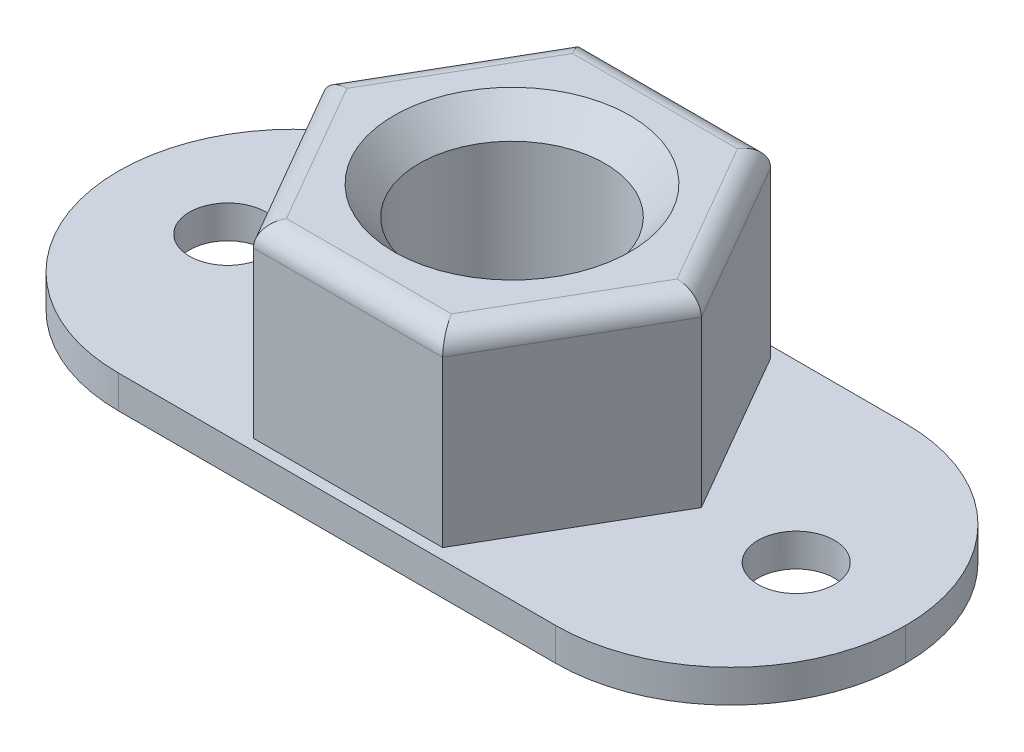
ISO-10303-21;
HEADER;
FILE_DESCRIPTION(('STEP AP214'),'2;1');
FILE_NAME('part.step','',(''),(''),'','','');
FILE_SCHEMA(('AUTOMOTIVE_DESIGN { 1 0 10303 214 1 1 1 1 }'));
ENDSEC;
DATA;
#1=APPLICATION_CONTEXT('core data for automotive mechanical design processes');
#2=APPLICATION_PROTOCOL_DEFINITION('international standard','automotive_design',2000,#1);
#3=PRODUCT_CONTEXT('',#1,'mechanical');
#4=PRODUCT('Part','Part','',(#3));
#5=PRODUCT_RELATED_PRODUCT_CATEGORY('part','',(#4));
#6=PRODUCT_DEFINITION_FORMATION('','',#4);
#7=PRODUCT_DEFINITION_CONTEXT('part definition',#1,'design');
#8=PRODUCT_DEFINITION('design','',#6,#7);
#9=PRODUCT_DEFINITION_SHAPE('','',#8);
#10=(LENGTH_UNIT() NAMED_UNIT(*) SI_UNIT(.MILLI.,.METRE.));
#11=(NAMED_UNIT(*) PLANE_ANGLE_UNIT() SI_UNIT($,.RADIAN.));
#12=(NAMED_UNIT(*) SI_UNIT($,.STERADIAN.) SOLID_ANGLE_UNIT());
#13=UNCERTAINTY_MEASURE_WITH_UNIT(LENGTH_MEASURE(1.E-05),#10,'distance_accuracy_value','');
#14=(GEOMETRIC_REPRESENTATION_CONTEXT(3) GLOBAL_UNCERTAINTY_ASSIGNED_CONTEXT((#13)) GLOBAL_UNIT_ASSIGNED_CONTEXT((#10,
#11,#12)) REPRESENTATION_CONTEXT('',''));
#15=CARTESIAN_POINT('',(0.,0.,0.));
#16=DIRECTION('',(0.,0.,1.));
#17=DIRECTION('',(1.,0.,0.));
#18=AXIS2_PLACEMENT_3D('',#15,#16,#17);
#19=CARTESIAN_POINT('',(6.87407664253899,13.49375,11.90625));
#20=DIRECTION('',(-0.866025403784438,0.,-0.5));
#21=DIRECTION('',(-0.5,0.,0.866025403784439));
#22=AXIS2_PLACEMENT_3D('',#19,#20,#21);
#23=PLANE('',#22);
#24=DIRECTION('',(0.,-1.,0.));
#25=VECTOR('',#24,1.);
#26=CARTESIAN_POINT('',(13.748153285078,13.49375,0.));
#27=LINE('',#26,#25);
#28=CARTESIAN_POINT('',(13.748153285078,11.96975,0.));
#29=VERTEX_POINT('',#28);
#30=CARTESIAN_POINT('',(13.748153285078,0.,0.));
#31=VERTEX_POINT('',#30);
#32=EDGE_CURVE('E157',#29,#31,#27,.T.);
#33=ORIENTED_EDGE('',*,*,#32,.F.);
#34=DIRECTION('',(0.5,0.,-0.866025403784439));
#35=VECTOR('',#34,1.);
#36=CARTESIAN_POINT('',(6.87407664253899,11.96975,11.90625));
#37=LINE('',#36,#35);
#38=CARTESIAN_POINT('',(6.87407664253899,11.96975,11.90625));
#39=VERTEX_POINT('',#38);
#40=EDGE_CURVE('E213',#29,#39,#37,.F.);
#41=ORIENTED_EDGE('',*,*,#40,.T.);
#42=DIRECTION('',(0.,-1.,0.));
#43=VECTOR('',#42,1.);
#44=CARTESIAN_POINT('',(6.87407664253899,13.49375,11.90625));
#45=LINE('',#44,#43);
#46=CARTESIAN_POINT('',(6.87407664253899,0.,11.90625));
#47=VERTEX_POINT('',#46);
#48=EDGE_CURVE('E167',#39,#47,#45,.T.);
#49=ORIENTED_EDGE('',*,*,#48,.T.);
#50=DIRECTION('',(0.5,0.,-0.866025403784438));
#51=VECTOR('',#50,1.);
#52=CARTESIAN_POINT('',(6.87407664253899,0.,11.90625));
#53=LINE('',#52,#51);
#54=EDGE_CURVE('E148',#47,#31,#53,.T.);
#55=ORIENTED_EDGE('',*,*,#54,.T.);
#56=EDGE_LOOP('',(#33,#41,#49,#55));
#57=FACE_BOUND('',#56,.T.);
#58=ADVANCED_FACE('F36',(#57),#23,.F.);
#59=CARTESIAN_POINT('',(13.748153285078,13.49375,0.));
#60=DIRECTION('',(-0.866025403784438,0.,0.5));
#61=DIRECTION('',(0.5,0.,0.866025403784439));
#62=AXIS2_PLACEMENT_3D('',#59,#60,#61);
#63=PLANE('',#62);
#64=DIRECTION('',(0.,-1.,0.));
#65=VECTOR('',#64,1.);
#66=CARTESIAN_POINT('',(6.87407664253898,13.49375,-11.90625));
#67=LINE('',#66,#65);
#68=CARTESIAN_POINT('',(6.87407664253898,11.96975,-11.90625));
#69=VERTEX_POINT('',#68);
#70=CARTESIAN_POINT('',(6.87407664253898,0.,-11.90625));
#71=VERTEX_POINT('',#70);
#72=EDGE_CURVE('E164',#69,#71,#67,.T.);
#73=ORIENTED_EDGE('',*,*,#72,.F.);
#74=DIRECTION('',(-0.5,0.,-0.866025403784439));
#75=VECTOR('',#74,1.);
#76=CARTESIAN_POINT('',(13.748153285078,11.96975,0.));
#77=LINE('',#76,#75);
#78=EDGE_CURVE('E160',#69,#29,#77,.F.);
#79=ORIENTED_EDGE('',*,*,#78,.T.);
#80=ORIENTED_EDGE('',*,*,#32,.T.);
#81=DIRECTION('',(-0.5,0.,-0.866025403784439));
#82=VECTOR('',#81,1.);
#83=CARTESIAN_POINT('',(13.748153285078,0.,0.));
#84=LINE('',#83,#82);
#85=EDGE_CURVE('E144',#31,#71,#84,.T.);
#86=ORIENTED_EDGE('',*,*,#85,.T.);
#87=EDGE_LOOP('',(#73,#79,#80,#86));
#88=FACE_BOUND('',#87,.T.);
#89=ADVANCED_FACE('F158',(#88),#63,.F.);
#90=CARTESIAN_POINT('',(6.87407664253898,13.49375,-11.90625));
#91=DIRECTION('',(0.,0.,1.));
#92=DIRECTION('',(1.,0.,0.));
#93=AXIS2_PLACEMENT_3D('',#90,#91,#92);
#94=PLANE('',#93);
#95=DIRECTION('',(0.,-1.,0.));
#96=VECTOR('',#95,1.);
#97=CARTESIAN_POINT('',(-6.87407664253898,13.49375,-11.90625));
#98=LINE('',#97,#96);
#99=CARTESIAN_POINT('',(-6.87407664253898,11.96975,-11.90625));
#100=VERTEX_POINT('',#99);
#101=CARTESIAN_POINT('',(-6.87407664253898,0.,-11.90625));
#102=VERTEX_POINT('',#101);
#103=EDGE_CURVE('E193',#100,#102,#98,.T.);
#104=ORIENTED_EDGE('',*,*,#103,.F.);
#105=DIRECTION('',(-1.,0.,0.));
#106=VECTOR('',#105,1.);
#107=CARTESIAN_POINT('',(6.87407664253898,11.96975,-11.90625));
#108=LINE('',#107,#106);
#109=EDGE_CURVE('E209',#100,#69,#108,.F.);
#110=ORIENTED_EDGE('',*,*,#109,.T.);
#111=ORIENTED_EDGE('',*,*,#72,.T.);
#112=DIRECTION('',(-1.,0.,0.));
#113=VECTOR('',#112,1.);
#114=CARTESIAN_POINT('',(6.87407664253898,0.,-11.90625));
#115=LINE('',#114,#113);
#116=EDGE_CURVE('E151',#71,#102,#115,.T.);
#117=ORIENTED_EDGE('',*,*,#116,.T.);
#118=EDGE_LOOP('',(#104,#110,#111,#117));
#119=FACE_BOUND('',#118,.T.);
#120=ADVANCED_FACE('F319',(#119),#94,.F.);
#121=CARTESIAN_POINT('',(-6.87407664253898,13.49375,-11.90625));
#122=DIRECTION('',(0.866025403784439,0.,0.5));
#123=DIRECTION('',(0.5,0.,-0.866025403784439));
#124=AXIS2_PLACEMENT_3D('',#121,#122,#123);
#125=PLANE('',#124);
#126=DIRECTION('',(0.,-1.,0.));
#127=VECTOR('',#126,1.);
#128=CARTESIAN_POINT('',(-13.748153285078,13.49375,0.));
#129=LINE('',#128,#127);
#130=CARTESIAN_POINT('',(-13.748153285078,11.96975,0.));
#131=VERTEX_POINT('',#130);
#132=CARTESIAN_POINT('',(-13.748153285078,0.,0.));
#133=VERTEX_POINT('',#132);
#134=EDGE_CURVE('E190',#131,#133,#129,.T.);
#135=ORIENTED_EDGE('',*,*,#134,.F.);
#136=DIRECTION('',(-0.5,0.,0.866025403784439));
#137=VECTOR('',#136,1.);
#138=CARTESIAN_POINT('',(-6.87407664253898,11.96975,-11.90625));
#139=LINE('',#138,#137);
#140=EDGE_CURVE('E219',#131,#100,#139,.F.);
#141=ORIENTED_EDGE('',*,*,#140,.T.);
#142=ORIENTED_EDGE('',*,*,#103,.T.);
#143=DIRECTION('',(-0.5,0.,0.866025403784439));
#144=VECTOR('',#143,1.);
#145=CARTESIAN_POINT('',(-6.87407664253898,0.,-11.90625));
#146=LINE('',#145,#144);
#147=EDGE_CURVE('E178',#102,#133,#146,.T.);
#148=ORIENTED_EDGE('',*,*,#147,.T.);
#149=EDGE_LOOP('',(#135,#141,#142,#148));
#150=FACE_BOUND('',#149,.T.);
#151=ADVANCED_FACE('F529',(#150),#125,.F.);
#152=CARTESIAN_POINT('',(-13.748153285078,13.49375,0.));
#153=DIRECTION('',(0.866025403784438,0.,-0.5));
#154=DIRECTION('',(-0.5,0.,-0.866025403784438));
#155=AXIS2_PLACEMENT_3D('',#152,#153,#154);
#156=PLANE('',#155);
#157=DIRECTION('',(0.,-1.,0.));
#158=VECTOR('',#157,1.);
#159=CARTESIAN_POINT('',(-6.87407664253898,13.49375,11.90625));
#160=LINE('',#159,#158);
#161=CARTESIAN_POINT('',(-6.87407664253898,11.96975,11.90625));
#162=VERTEX_POINT('',#161);
#163=CARTESIAN_POINT('',(-6.87407664253898,0.,11.90625));
#164=VERTEX_POINT('',#163);
#165=EDGE_CURVE('E187',#162,#164,#160,.T.);
#166=ORIENTED_EDGE('',*,*,#165,.F.);
#167=DIRECTION('',(0.5,0.,0.866025403784438));
#168=VECTOR('',#167,1.);
#169=CARTESIAN_POINT('',(-13.748153285078,11.96975,0.));
#170=LINE('',#169,#168);
#171=EDGE_CURVE('E217',#162,#131,#170,.F.);
#172=ORIENTED_EDGE('',*,*,#171,.T.);
#173=ORIENTED_EDGE('',*,*,#134,.T.);
#174=DIRECTION('',(0.5,0.,0.866025403784438));
#175=VECTOR('',#174,1.);
#176=CARTESIAN_POINT('',(-13.748153285078,0.,0.));
#177=LINE('',#176,#175);
#178=EDGE_CURVE('E181',#133,#164,#177,.T.);
#179=ORIENTED_EDGE('',*,*,#178,.T.);
#180=EDGE_LOOP('',(#166,#172,#173,#179));
#181=FACE_BOUND('',#180,.T.);
#182=ADVANCED_FACE('F311',(#181),#156,.F.);
#183=CARTESIAN_POINT('',(-6.87407664253898,13.49375,11.90625));
#184=DIRECTION('',(0.,0.,-1.));
#185=DIRECTION('',(-1.,0.,0.));
#186=AXIS2_PLACEMENT_3D('',#183,#184,#185);
#187=PLANE('',#186);
#188=ORIENTED_EDGE('',*,*,#48,.F.);
#189=DIRECTION('',(1.,0.,0.));
#190=VECTOR('',#189,1.);
#191=CARTESIAN_POINT('',(-6.87407664253898,11.96975,11.90625));
#192=LINE('',#191,#190);
#193=EDGE_CURVE('E215',#39,#162,#192,.F.);
#194=ORIENTED_EDGE('',*,*,#193,.T.);
#195=ORIENTED_EDGE('',*,*,#165,.T.);
#196=DIRECTION('',(1.,0.,0.));
#197=VECTOR('',#196,1.);
#198=CARTESIAN_POINT('',(-6.87407664253898,0.,11.90625));
#199=LINE('',#198,#197);
#200=EDGE_CURVE('E184',#164,#47,#199,.T.);
#201=ORIENTED_EDGE('',*,*,#200,.T.);
#202=EDGE_LOOP('',(#188,#194,#195,#201));
#203=FACE_BOUND('',#202,.T.);
#204=ADVANCED_FACE('F302',(#203),#187,.F.);
#205=CARTESIAN_POINT('',(0.,13.49375,0.));
#206=DIRECTION('',(0.,1.,0.));
#207=DIRECTION('',(0.,0.,1.));
#208=AXIS2_PLACEMENT_3D('',#205,#206,#207);
#209=PLANE('',#208);
#210=DIRECTION('',(-0.5,0.,-0.866025403784439));
#211=VECTOR('',#210,1.);
#212=CARTESIAN_POINT('',(5.5542539271715,13.49375,-11.14425));
#213=LINE('',#212,#211);
#214=CARTESIAN_POINT('',(11.988389664588,13.49375,0.));
#215=VERTEX_POINT('',#214);
#216=CARTESIAN_POINT('',(5.99419483229399,13.49375,-10.38225));
#217=VERTEX_POINT('',#216);
#218=EDGE_CURVE('E204',#215,#217,#213,.T.);
#219=ORIENTED_EDGE('',*,*,#218,.T.);
#220=DIRECTION('',(-1.,0.,0.));
#221=VECTOR('',#220,1.);
#222=CARTESIAN_POINT('',(-6.87407664253898,13.49375,-10.38225));
#223=LINE('',#222,#221);
#224=CARTESIAN_POINT('',(-5.99419483229399,13.49375,-10.38225));
#225=VERTEX_POINT('',#224);
#226=EDGE_CURVE('E206',#217,#225,#223,.T.);
#227=ORIENTED_EDGE('',*,*,#226,.T.);
#228=DIRECTION('',(-0.5,0.,0.866025403784439));
#229=VECTOR('',#228,1.);
#230=CARTESIAN_POINT('',(-12.4283305697105,13.49375,0.761999999999997));
#231=LINE('',#230,#229);
#232=CARTESIAN_POINT('',(-11.988389664588,13.49375,0.));
#233=VERTEX_POINT('',#232);
#234=EDGE_CURVE('E163',#225,#233,#231,.T.);
#235=ORIENTED_EDGE('',*,*,#234,.T.);
#236=DIRECTION('',(0.5,0.,0.866025403784438));
#237=VECTOR('',#236,1.);
#238=CARTESIAN_POINT('',(-5.55425392717149,13.49375,11.14425));
#239=LINE('',#238,#237);
#240=CARTESIAN_POINT('',(-5.99419483229399,13.49375,10.38225));
#241=VERTEX_POINT('',#240);
#242=EDGE_CURVE('E198',#233,#241,#239,.T.);
#243=ORIENTED_EDGE('',*,*,#242,.T.);
#244=DIRECTION('',(1.,0.,0.));
#245=VECTOR('',#244,1.);
#246=CARTESIAN_POINT('',(6.87407664253899,13.49375,10.38225));
#247=LINE('',#246,#245);
#248=CARTESIAN_POINT('',(5.994194832294,13.49375,10.38225));
#249=VERTEX_POINT('',#248);
#250=EDGE_CURVE('E200',#241,#249,#247,.T.);
#251=ORIENTED_EDGE('',*,*,#250,.T.);
#252=DIRECTION('',(0.5,0.,-0.866025403784439));
#253=VECTOR('',#252,1.);
#254=CARTESIAN_POINT('',(12.4283305697105,13.49375,-0.761999999999999));
#255=LINE('',#254,#253);
#256=EDGE_CURVE('E202',#249,#215,#255,.T.);
#257=ORIENTED_EDGE('',*,*,#256,.T.);
#258=EDGE_LOOP('',(#219,#227,#235,#243,#251,#257));
#259=FACE_BOUND('',#258,.T.);
#260=CARTESIAN_POINT('',(0.,13.49375,0.));
#261=DIRECTION('',(0.,1.,0.));
#262=DIRECTION('',(0.,0.,1.));
#263=AXIS2_PLACEMENT_3D('',#260,#261,#262);
#264=CIRCLE('',#263,8.5725);
#265=CARTESIAN_POINT('',(0.,13.49375,8.5725));
#266=VERTEX_POINT('',#265);
#267=EDGE_CURVE('E172',#266,#266,#264,.T.);
#268=ORIENTED_EDGE('',*,*,#267,.F.);
#269=EDGE_LOOP('',(#268));
#270=FACE_BOUND('',#269,.T.);
#271=ADVANCED_FACE('F299',(#259,#270),#209,.T.);
#272=CARTESIAN_POINT('',(0.,13.49375,0.));
#273=DIRECTION('',(0.,1.,0.));
#274=DIRECTION('',(0.,0.,1.));
#275=AXIS2_PLACEMENT_3D('',#272,#273,#274);
#276=CYLINDRICAL_SURFACE('',#275,6.74624);
#277=CARTESIAN_POINT('',(0.,0.,0.));
#278=DIRECTION('',(0.,1.,0.));
#279=DIRECTION('',(0.,0.,1.));
#280=AXIS2_PLACEMENT_3D('',#277,#278,#279);
#281=CIRCLE('',#280,6.74623999999999);
#282=CARTESIAN_POINT('',(0.,0.,6.74623999999999));
#283=VERTEX_POINT('',#282);
#284=EDGE_CURVE('E175',#283,#283,#281,.T.);
#285=ORIENTED_EDGE('',*,*,#284,.F.);
#286=EDGE_LOOP('',(#285));
#287=FACE_BOUND('',#286,.T.);
#288=CARTESIAN_POINT('',(0.,11.3928781926286,0.));
#289=DIRECTION('',(0.,1.,0.));
#290=DIRECTION('',(0.,0.,1.));
#291=AXIS2_PLACEMENT_3D('',#288,#289,#290);
#292=CIRCLE('',#291,6.74624);
#293=CARTESIAN_POINT('',(0.,11.3928781926286,6.74624));
#294=VERTEX_POINT('',#293);
#295=EDGE_CURVE('E169',#294,#294,#292,.T.);
#296=ORIENTED_EDGE('',*,*,#295,.T.);
#297=EDGE_LOOP('',(#296));
#298=FACE_BOUND('',#297,.T.);
#299=ADVANCED_FACE('F301',(#287,#298),#276,.F.);
#300=CARTESIAN_POINT('',(0.,13.49375,0.));
#301=DIRECTION('',(0.,1.,0.));
#302=DIRECTION('',(0.,0.,1.));
#303=AXIS2_PLACEMENT_3D('',#300,#301,#302);
#304=CONICAL_SURFACE('',#303,8.5725,0.715584993317675);
#305=ORIENTED_EDGE('',*,*,#295,.F.);
#306=EDGE_LOOP('',(#305));
#307=FACE_BOUND('',#306,.T.);
#308=ORIENTED_EDGE('',*,*,#267,.T.);
#309=EDGE_LOOP('',(#308));
#310=FACE_BOUND('',#309,.T.);
#311=ADVANCED_FACE('F297',(#307,#310),#304,.F.);
#312=CARTESIAN_POINT('',(0.,11.96975,10.38225));
#313=DIRECTION('',(-1.,0.,0.));
#314=DIRECTION('',(0.,0.,1.));
#315=AXIS2_PLACEMENT_3D('',#312,#313,#314);
#316=CYLINDRICAL_SURFACE('',#315,1.524);
#317=CARTESIAN_POINT('',(-5.99419483229399,11.96975,10.38225));
#318=DIRECTION('',(-0.866025403784439,0.,-0.5));
#319=DIRECTION('',(0.5,0.,-0.866025403784439));
#320=AXIS2_PLACEMENT_3D('',#317,#318,#319);
#321=ELLIPSE('',#320,1.75976362048998,1.524);
#322=EDGE_CURVE('E233',#162,#241,#321,.T.);
#323=ORIENTED_EDGE('',*,*,#322,.F.);
#324=ORIENTED_EDGE('',*,*,#193,.F.);
#325=CARTESIAN_POINT('',(5.994194832294,11.96975,10.38225));
#326=DIRECTION('',(-0.866025403784439,0.,0.5));
#327=DIRECTION('',(-0.5,0.,-0.866025403784439));
#328=AXIS2_PLACEMENT_3D('',#325,#326,#327);
#329=ELLIPSE('',#328,1.75976362048998,1.524);
#330=EDGE_CURVE('E236',#249,#39,#329,.F.);
#331=ORIENTED_EDGE('',*,*,#330,.F.);
#332=ORIENTED_EDGE('',*,*,#250,.F.);
#333=EDGE_LOOP('',(#323,#324,#331,#332));
#334=FACE_BOUND('',#333,.T.);
#335=ADVANCED_FACE('F343',(#334),#316,.T.);
#336=CARTESIAN_POINT('',(8.99129224844099,11.96975,5.191125));
#337=DIRECTION('',(-0.5,0.,0.866025403784439));
#338=DIRECTION('',(0.866025403784439,0.,0.5));
#339=AXIS2_PLACEMENT_3D('',#336,#337,#338);
#340=CYLINDRICAL_SURFACE('',#339,1.524);
#341=ORIENTED_EDGE('',*,*,#330,.T.);
#342=ORIENTED_EDGE('',*,*,#40,.F.);
#343=CARTESIAN_POINT('',(11.988389664588,11.96975,0.));
#344=DIRECTION('',(0.,0.,1.));
#345=DIRECTION('',(-1.,0.,0.));
#346=AXIS2_PLACEMENT_3D('',#343,#344,#345);
#347=ELLIPSE('',#346,1.75976362048998,1.524);
#348=EDGE_CURVE('E230',#215,#29,#347,.F.);
#349=ORIENTED_EDGE('',*,*,#348,.F.);
#350=ORIENTED_EDGE('',*,*,#256,.F.);
#351=EDGE_LOOP('',(#341,#342,#349,#350));
#352=FACE_BOUND('',#351,.T.);
#353=ADVANCED_FACE('F339',(#352),#340,.T.);
#354=CARTESIAN_POINT('',(-8.99129224844098,11.96975,5.191125));
#355=DIRECTION('',(-0.5,0.,-0.866025403784438));
#356=DIRECTION('',(-0.866025403784438,0.,0.5));
#357=AXIS2_PLACEMENT_3D('',#354,#355,#356);
#358=CYLINDRICAL_SURFACE('',#357,1.524);
#359=ORIENTED_EDGE('',*,*,#322,.T.);
#360=ORIENTED_EDGE('',*,*,#242,.F.);
#361=CARTESIAN_POINT('',(-11.988389664588,11.96975,0.));
#362=DIRECTION('',(0.,0.,-1.));
#363=DIRECTION('',(1.,0.,0.));
#364=AXIS2_PLACEMENT_3D('',#361,#362,#363);
#365=ELLIPSE('',#364,1.75976362048998,1.524);
#366=EDGE_CURVE('E227',#131,#233,#365,.T.);
#367=ORIENTED_EDGE('',*,*,#366,.F.);
#368=ORIENTED_EDGE('',*,*,#171,.F.);
#369=EDGE_LOOP('',(#359,#360,#367,#368));
#370=FACE_BOUND('',#369,.T.);
#371=ADVANCED_FACE('F335',(#370),#358,.T.);
#372=CARTESIAN_POINT('',(8.99129224844099,11.96975,-5.191125));
#373=DIRECTION('',(0.5,0.,0.866025403784439));
#374=DIRECTION('',(0.866025403784438,0.,-0.5));
#375=AXIS2_PLACEMENT_3D('',#372,#373,#374);
#376=CYLINDRICAL_SURFACE('',#375,1.524);
#377=ORIENTED_EDGE('',*,*,#348,.T.);
#378=ORIENTED_EDGE('',*,*,#78,.F.);
#379=CARTESIAN_POINT('',(5.99419483229399,11.96975,-10.38225));
#380=DIRECTION('',(0.866025403784439,0.,0.5));
#381=DIRECTION('',(-0.5,0.,0.866025403784439));
#382=AXIS2_PLACEMENT_3D('',#379,#380,#381);
#383=ELLIPSE('',#382,1.75976362048998,1.524);
#384=EDGE_CURVE('E224',#217,#69,#383,.F.);
#385=ORIENTED_EDGE('',*,*,#384,.F.);
#386=ORIENTED_EDGE('',*,*,#218,.F.);
#387=EDGE_LOOP('',(#377,#378,#385,#386));
#388=FACE_BOUND('',#387,.T.);
#389=ADVANCED_FACE('F331',(#388),#376,.T.);
#390=CARTESIAN_POINT('',(-8.99129224844099,11.96975,-5.191125));
#391=DIRECTION('',(0.5,0.,-0.866025403784439));
#392=DIRECTION('',(-0.866025403784439,0.,-0.5));
#393=AXIS2_PLACEMENT_3D('',#390,#391,#392);
#394=CYLINDRICAL_SURFACE('',#393,1.524);
#395=ORIENTED_EDGE('',*,*,#366,.T.);
#396=ORIENTED_EDGE('',*,*,#234,.F.);
#397=CARTESIAN_POINT('',(-5.99419483229399,11.96975,-10.38225));
#398=DIRECTION('',(0.866025403784439,0.,-0.5));
#399=DIRECTION('',(-0.5,0.,-0.866025403784439));
#400=AXIS2_PLACEMENT_3D('',#397,#398,#399);
#401=ELLIPSE('',#400,1.75976362048998,1.524);
#402=EDGE_CURVE('E222',#100,#225,#401,.T.);
#403=ORIENTED_EDGE('',*,*,#402,.F.);
#404=ORIENTED_EDGE('',*,*,#140,.F.);
#405=EDGE_LOOP('',(#395,#396,#403,#404));
#406=FACE_BOUND('',#405,.T.);
#407=ADVANCED_FACE('F327',(#406),#394,.T.);
#408=CARTESIAN_POINT('',(0.,11.96975,-10.38225));
#409=DIRECTION('',(1.,0.,0.));
#410=DIRECTION('',(0.,0.,-1.));
#411=AXIS2_PLACEMENT_3D('',#408,#409,#410);
#412=CYLINDRICAL_SURFACE('',#411,1.524);
#413=ORIENTED_EDGE('',*,*,#384,.T.);
#414=ORIENTED_EDGE('',*,*,#109,.F.);
#415=ORIENTED_EDGE('',*,*,#402,.T.);
#416=ORIENTED_EDGE('',*,*,#226,.F.);
#417=EDGE_LOOP('',(#413,#414,#415,#416));
#418=FACE_BOUND('',#417,.T.);
#419=ADVANCED_FACE('F323',(#418),#412,.T.);
#420=CARTESIAN_POINT('',(0.,-2.38125,0.));
#421=DIRECTION('',(0.,1.,0.));
#422=DIRECTION('',(0.,0.,1.));
#423=AXIS2_PLACEMENT_3D('',#420,#421,#422);
#424=PLANE('',#423);
#425=CARTESIAN_POINT('',(-20.6375,-2.38125,0.));
#426=DIRECTION('',(0.,-1.,0.));
#427=DIRECTION('',(0.,0.,-1.));
#428=AXIS2_PLACEMENT_3D('',#425,#426,#427);
#429=CIRCLE('',#428,2.778125);
#430=CARTESIAN_POINT('',(-20.6375,-2.38125,-2.778125));
#431=VERTEX_POINT('',#430);
#432=EDGE_CURVE('E268',#431,#431,#429,.T.);
#433=ORIENTED_EDGE('',*,*,#432,.F.);
#434=EDGE_LOOP('',(#433));
#435=FACE_BOUND('',#434,.T.);
#436=CARTESIAN_POINT('',(20.6375,-2.38125,0.));
#437=DIRECTION('',(0.,-1.,0.));
#438=DIRECTION('',(0.,0.,-1.));
#439=AXIS2_PLACEMENT_3D('',#436,#437,#438);
#440=CIRCLE('',#439,2.778125);
#441=CARTESIAN_POINT('',(20.6375,-2.38125,-2.778125));
#442=VERTEX_POINT('',#441);
#443=EDGE_CURVE('E274',#442,#442,#440,.T.);
#444=ORIENTED_EDGE('',*,*,#443,.F.);
#445=EDGE_LOOP('',(#444));
#446=FACE_BOUND('',#445,.T.);
#447=CARTESIAN_POINT('',(0.,-2.38125,0.));
#448=DIRECTION('',(0.,-1.,0.));
#449=DIRECTION('',(0.,0.,-1.));
#450=AXIS2_PLACEMENT_3D('',#447,#448,#449);
#451=CIRCLE('',#450,9.525);
#452=CARTESIAN_POINT('',(0.,-2.38125,-9.525));
#453=VERTEX_POINT('',#452);
#454=EDGE_CURVE('E272',#453,#453,#451,.T.);
#455=ORIENTED_EDGE('',*,*,#454,.F.);
#456=EDGE_LOOP('',(#455));
#457=FACE_BOUND('',#456,.T.);
#458=CARTESIAN_POINT('',(-15.875,-2.38125,0.));
#459=DIRECTION('',(0.,1.,0.));
#460=DIRECTION('',(0.,0.,1.));
#461=AXIS2_PLACEMENT_3D('',#458,#459,#460);
#462=CIRCLE('',#461,12.7);
#463=CARTESIAN_POINT('',(-15.875,-2.38125,12.7));
#464=VERTEX_POINT('',#463);
#465=CARTESIAN_POINT('',(-28.575,-2.38125,0.));
#466=VERTEX_POINT('',#465);
#467=EDGE_CURVE('E53',#464,#466,#462,.F.);
#468=ORIENTED_EDGE('',*,*,#467,.T.);
#469=CARTESIAN_POINT('',(-15.875,-2.38125,0.));
#470=DIRECTION('',(0.,1.,0.));
#471=DIRECTION('',(0.,0.,1.));
#472=AXIS2_PLACEMENT_3D('',#469,#470,#471);
#473=CIRCLE('',#472,12.7);
#474=CARTESIAN_POINT('',(-15.875,-2.38125,-12.7));
#475=VERTEX_POINT('',#474);
#476=EDGE_CURVE('E257',#466,#475,#473,.F.);
#477=ORIENTED_EDGE('',*,*,#476,.T.);
#478=DIRECTION('',(1.,0.,0.));
#479=VECTOR('',#478,1.);
#480=CARTESIAN_POINT('',(-28.575,-2.38125,-12.7));
#481=LINE('',#480,#479);
#482=CARTESIAN_POINT('',(15.875,-2.38125,-12.7));
#483=VERTEX_POINT('',#482);
#484=EDGE_CURVE('E225',#475,#483,#481,.T.);
#485=ORIENTED_EDGE('',*,*,#484,.T.);
#486=CARTESIAN_POINT('',(15.875,-2.38125,0.));
#487=DIRECTION('',(0.,1.,0.));
#488=DIRECTION('',(0.,0.,1.));
#489=AXIS2_PLACEMENT_3D('',#486,#487,#488);
#490=CIRCLE('',#489,12.7);
#491=CARTESIAN_POINT('',(28.575,-2.38125,0.));
#492=VERTEX_POINT('',#491);
#493=EDGE_CURVE('E254',#483,#492,#490,.F.);
#494=ORIENTED_EDGE('',*,*,#493,.T.);
#495=CARTESIAN_POINT('',(15.875,-2.38125,0.));
#496=DIRECTION('',(0.,1.,0.));
#497=DIRECTION('',(0.,0.,1.));
#498=AXIS2_PLACEMENT_3D('',#495,#496,#497);
#499=CIRCLE('',#498,12.7);
#500=CARTESIAN_POINT('',(15.875,-2.38125,12.7));
#501=VERTEX_POINT('',#500);
#502=EDGE_CURVE('E252',#492,#501,#499,.F.);
#503=ORIENTED_EDGE('',*,*,#502,.T.);
#504=DIRECTION('',(-1.,0.,0.));
#505=VECTOR('',#504,1.);
#506=CARTESIAN_POINT('',(-28.575,-2.38125,12.7));
#507=LINE('',#506,#505);
#508=EDGE_CURVE('E286',#501,#464,#507,.T.);
#509=ORIENTED_EDGE('',*,*,#508,.T.);
#510=EDGE_LOOP('',(#468,#477,#485,#494,#503,#509));
#511=FACE_BOUND('',#510,.T.);
#512=ADVANCED_FACE('F326',(#435,#446,#457,#511),#424,.F.);
#513=CARTESIAN_POINT('',(-28.575,-2.38125,-12.7));
#514=DIRECTION('',(0.,0.,1.));
#515=DIRECTION('',(1.,0.,0.));
#516=AXIS2_PLACEMENT_3D('',#513,#514,#515);
#517=PLANE('',#516);
#518=ORIENTED_EDGE('',*,*,#484,.F.);
#519=DIRECTION('',(0.,1.,0.));
#520=VECTOR('',#519,1.);
#521=CARTESIAN_POINT('',(-15.875,-2.38125,-12.7));
#522=LINE('',#521,#520);
#523=CARTESIAN_POINT('',(-15.875,0.,-12.7));
#524=VERTEX_POINT('',#523);
#525=EDGE_CURVE('E241',#475,#524,#522,.T.);
#526=ORIENTED_EDGE('',*,*,#525,.T.);
#527=DIRECTION('',(1.,0.,0.));
#528=VECTOR('',#527,1.);
#529=CARTESIAN_POINT('',(-28.575,0.,-12.7));
#530=LINE('',#529,#528);
#531=CARTESIAN_POINT('',(15.875,0.,-12.7));
#532=VERTEX_POINT('',#531);
#533=EDGE_CURVE('E288',#524,#532,#530,.T.);
#534=ORIENTED_EDGE('',*,*,#533,.T.);
#535=DIRECTION('',(0.,1.,0.));
#536=VECTOR('',#535,1.);
#537=CARTESIAN_POINT('',(15.875,-2.38125,-12.7));
#538=LINE('',#537,#536);
#539=EDGE_CURVE('E221',#532,#483,#538,.F.);
#540=ORIENTED_EDGE('',*,*,#539,.T.);
#541=EDGE_LOOP('',(#518,#526,#534,#540));
#542=FACE_BOUND('',#541,.T.);
#543=ADVANCED_FACE('F373',(#542),#517,.F.);
#544=CARTESIAN_POINT('',(-28.575,-2.38125,12.7));
#545=DIRECTION('',(0.,0.,-1.));
#546=DIRECTION('',(-1.,0.,0.));
#547=AXIS2_PLACEMENT_3D('',#544,#545,#546);
#548=PLANE('',#547);
#549=DIRECTION('',(-1.,0.,0.));
#550=VECTOR('',#549,1.);
#551=CARTESIAN_POINT('',(-28.575,0.,12.7));
#552=LINE('',#551,#550);
#553=CARTESIAN_POINT('',(15.875,0.,12.7));
#554=VERTEX_POINT('',#553);
#555=CARTESIAN_POINT('',(-15.875,0.,12.7));
#556=VERTEX_POINT('',#555);
#557=EDGE_CURVE('E263',#554,#556,#552,.T.);
#558=ORIENTED_EDGE('',*,*,#557,.T.);
#559=DIRECTION('',(0.,1.,0.));
#560=VECTOR('',#559,1.);
#561=CARTESIAN_POINT('',(-15.875,-2.38125,12.7));
#562=LINE('',#561,#560);
#563=EDGE_CURVE('E11',#556,#464,#562,.F.);
#564=ORIENTED_EDGE('',*,*,#563,.T.);
#565=ORIENTED_EDGE('',*,*,#508,.F.);
#566=DIRECTION('',(0.,1.,0.));
#567=VECTOR('',#566,1.);
#568=CARTESIAN_POINT('',(15.875,-2.38125,12.7));
#569=LINE('',#568,#567);
#570=EDGE_CURVE('E45',#501,#554,#569,.T.);
#571=ORIENTED_EDGE('',*,*,#570,.T.);
#572=EDGE_LOOP('',(#558,#564,#565,#571));
#573=FACE_BOUND('',#572,.T.);
#574=ADVANCED_FACE('F382',(#573),#548,.F.);
#575=CARTESIAN_POINT('',(0.,0.,0.));
#576=DIRECTION('',(0.,1.,0.));
#577=DIRECTION('',(0.,0.,1.));
#578=AXIS2_PLACEMENT_3D('',#575,#576,#577);
#579=PLANE('',#578);
#580=CARTESIAN_POINT('',(-20.6375,0.,0.));
#581=DIRECTION('',(0.,1.,0.));
#582=DIRECTION('',(0.,0.,1.));
#583=AXIS2_PLACEMENT_3D('',#580,#581,#582);
#584=CIRCLE('',#583,2.778125);
#585=CARTESIAN_POINT('',(-20.6375,0.,2.778125));
#586=VERTEX_POINT('',#585);
#587=EDGE_CURVE('E40',#586,#586,#584,.T.);
#588=ORIENTED_EDGE('',*,*,#587,.F.);
#589=EDGE_LOOP('',(#588));
#590=FACE_BOUND('',#589,.T.);
#591=CARTESIAN_POINT('',(20.6375,0.,0.));
#592=DIRECTION('',(0.,1.,0.));
#593=DIRECTION('',(0.,0.,1.));
#594=AXIS2_PLACEMENT_3D('',#591,#592,#593);
#595=CIRCLE('',#594,2.778125);
#596=CARTESIAN_POINT('',(20.6375,0.,2.778125));
#597=VERTEX_POINT('',#596);
#598=EDGE_CURVE('E266',#597,#597,#595,.T.);
#599=ORIENTED_EDGE('',*,*,#598,.F.);
#600=EDGE_LOOP('',(#599));
#601=FACE_BOUND('',#600,.T.);
#602=ORIENTED_EDGE('',*,*,#533,.F.);
#603=CARTESIAN_POINT('',(-15.875,0.,0.));
#604=DIRECTION('',(0.,1.,0.));
#605=DIRECTION('',(0.,0.,1.));
#606=AXIS2_PLACEMENT_3D('',#603,#604,#605);
#607=CIRCLE('',#606,12.7);
#608=CARTESIAN_POINT('',(-28.575,0.,0.));
#609=VERTEX_POINT('',#608);
#610=EDGE_CURVE('E250',#524,#609,#607,.T.);
#611=ORIENTED_EDGE('',*,*,#610,.T.);
#612=CARTESIAN_POINT('',(-15.875,0.,0.));
#613=DIRECTION('',(0.,1.,0.));
#614=DIRECTION('',(0.,0.,1.));
#615=AXIS2_PLACEMENT_3D('',#612,#613,#614);
#616=CIRCLE('',#615,12.7);
#617=EDGE_CURVE('E248',#609,#556,#616,.T.);
#618=ORIENTED_EDGE('',*,*,#617,.T.);
#619=ORIENTED_EDGE('',*,*,#557,.F.);
#620=CARTESIAN_POINT('',(15.875,0.,0.));
#621=DIRECTION('',(0.,1.,0.));
#622=DIRECTION('',(0.,0.,1.));
#623=AXIS2_PLACEMENT_3D('',#620,#621,#622);
#624=CIRCLE('',#623,12.7);
#625=CARTESIAN_POINT('',(28.575,0.,0.));
#626=VERTEX_POINT('',#625);
#627=EDGE_CURVE('E244',#554,#626,#624,.T.);
#628=ORIENTED_EDGE('',*,*,#627,.T.);
#629=CARTESIAN_POINT('',(15.875,0.,0.));
#630=DIRECTION('',(0.,1.,0.));
#631=DIRECTION('',(0.,0.,1.));
#632=AXIS2_PLACEMENT_3D('',#629,#630,#631);
#633=CIRCLE('',#632,12.7);
#634=EDGE_CURVE('E246',#626,#532,#633,.T.);
#635=ORIENTED_EDGE('',*,*,#634,.T.);
#636=EDGE_LOOP('',(#602,#611,#618,#619,#628,#635));
#637=FACE_BOUND('',#636,.T.);
#638=ORIENTED_EDGE('',*,*,#54,.F.);
#639=ORIENTED_EDGE('',*,*,#200,.F.);
#640=ORIENTED_EDGE('',*,*,#178,.F.);
#641=ORIENTED_EDGE('',*,*,#147,.F.);
#642=ORIENTED_EDGE('',*,*,#116,.F.);
#643=ORIENTED_EDGE('',*,*,#85,.F.);
#644=EDGE_LOOP('',(#638,#639,#640,#641,#642,#643));
#645=FACE_BOUND('',#644,.T.);
#646=ADVANCED_FACE('F146',(#590,#601,#637,#645),#579,.T.);
#647=CARTESIAN_POINT('',(-15.875,-2.38125,0.));
#648=DIRECTION('',(0.,1.,0.));
#649=DIRECTION('',(0.,0.,1.));
#650=AXIS2_PLACEMENT_3D('',#647,#648,#649);
#651=CYLINDRICAL_SURFACE('',#650,12.7);
#652=DIRECTION('',(0.,1.,0.));
#653=VECTOR('',#652,1.);
#654=CARTESIAN_POINT('',(-28.575,-2.38125,0.));
#655=LINE('',#654,#653);
#656=EDGE_CURVE('E260',#466,#609,#655,.T.);
#657=ORIENTED_EDGE('',*,*,#656,.F.);
#658=ORIENTED_EDGE('',*,*,#467,.F.);
#659=ORIENTED_EDGE('',*,*,#563,.F.);
#660=ORIENTED_EDGE('',*,*,#617,.F.);
#661=EDGE_LOOP('',(#657,#658,#659,#660));
#662=FACE_BOUND('',#661,.T.);
#663=ADVANCED_FACE('F351',(#662),#651,.T.);
#664=CARTESIAN_POINT('',(-15.875,-2.38125,0.));
#665=DIRECTION('',(0.,1.,0.));
#666=DIRECTION('',(0.,0.,1.));
#667=AXIS2_PLACEMENT_3D('',#664,#665,#666);
#668=CYLINDRICAL_SURFACE('',#667,12.7);
#669=ORIENTED_EDGE('',*,*,#476,.F.);
#670=ORIENTED_EDGE('',*,*,#656,.T.);
#671=ORIENTED_EDGE('',*,*,#610,.F.);
#672=ORIENTED_EDGE('',*,*,#525,.F.);
#673=EDGE_LOOP('',(#669,#670,#671,#672));
#674=FACE_BOUND('',#673,.T.);
#675=ADVANCED_FACE('F348',(#674),#668,.T.);
#676=CARTESIAN_POINT('',(15.875,-2.38125,0.));
#677=DIRECTION('',(0.,1.,0.));
#678=DIRECTION('',(0.,0.,1.));
#679=AXIS2_PLACEMENT_3D('',#676,#677,#678);
#680=CYLINDRICAL_SURFACE('',#679,12.7);
#681=ORIENTED_EDGE('',*,*,#570,.F.);
#682=ORIENTED_EDGE('',*,*,#502,.F.);
#683=DIRECTION('',(0.,1.,0.));
#684=VECTOR('',#683,1.);
#685=CARTESIAN_POINT('',(28.575,-2.38125,0.));
#686=LINE('',#685,#684);
#687=EDGE_CURVE('E264',#626,#492,#686,.F.);
#688=ORIENTED_EDGE('',*,*,#687,.F.);
#689=ORIENTED_EDGE('',*,*,#627,.F.);
#690=EDGE_LOOP('',(#681,#682,#688,#689));
#691=FACE_BOUND('',#690,.T.);
#692=ADVANCED_FACE('F38',(#691),#680,.T.);
#693=CARTESIAN_POINT('',(15.875,-2.38125,0.));
#694=DIRECTION('',(0.,1.,0.));
#695=DIRECTION('',(0.,0.,1.));
#696=AXIS2_PLACEMENT_3D('',#693,#694,#695);
#697=CYLINDRICAL_SURFACE('',#696,12.7);
#698=ORIENTED_EDGE('',*,*,#493,.F.);
#699=ORIENTED_EDGE('',*,*,#539,.F.);
#700=ORIENTED_EDGE('',*,*,#634,.F.);
#701=ORIENTED_EDGE('',*,*,#687,.T.);
#702=EDGE_LOOP('',(#698,#699,#700,#701));
#703=FACE_BOUND('',#702,.T.);
#704=ADVANCED_FACE('F355',(#703),#697,.T.);
#705=CARTESIAN_POINT('',(0.,0.,0.));
#706=DIRECTION('',(0.,1.,0.));
#707=DIRECTION('',(0.,0.,1.));
#708=AXIS2_PLACEMENT_3D('',#705,#706,#707);
#709=PLANE('',#708);
#710=ORIENTED_EDGE('',*,*,#284,.T.);
#711=EDGE_LOOP('',(#710));
#712=FACE_BOUND('',#711,.T.);
#713=CARTESIAN_POINT('',(0.,0.,0.));
#714=DIRECTION('',(0.,1.,0.));
#715=DIRECTION('',(0.,0.,1.));
#716=AXIS2_PLACEMENT_3D('',#713,#714,#715);
#717=CIRCLE('',#716,9.525);
#718=CARTESIAN_POINT('',(0.,0.,9.525));
#719=VERTEX_POINT('',#718);
#720=EDGE_CURVE('E283',#719,#719,#717,.F.);
#721=ORIENTED_EDGE('',*,*,#720,.T.);
#722=EDGE_LOOP('',(#721));
#723=FACE_BOUND('',#722,.T.);
#724=ADVANCED_FACE('F357',(#712,#723),#709,.F.);
#725=CARTESIAN_POINT('',(0.,26.9407683632075,0.));
#726=DIRECTION('',(0.,-1.,0.));
#727=DIRECTION('',(0.,0.,-1.));
#728=AXIS2_PLACEMENT_3D('',#725,#726,#727);
#729=CYLINDRICAL_SURFACE('',#728,9.525);
#730=ORIENTED_EDGE('',*,*,#454,.T.);
#731=EDGE_LOOP('',(#730));
#732=FACE_BOUND('',#731,.T.);
#733=ORIENTED_EDGE('',*,*,#720,.F.);
#734=EDGE_LOOP('',(#733));
#735=FACE_BOUND('',#734,.T.);
#736=ADVANCED_FACE('F363',(#732,#735),#729,.F.);
#737=CARTESIAN_POINT('',(20.6375,13.49375,0.));
#738=DIRECTION('',(0.,-1.,0.));
#739=DIRECTION('',(0.,0.,-1.));
#740=AXIS2_PLACEMENT_3D('',#737,#738,#739);
#741=CYLINDRICAL_SURFACE('',#740,2.778125);
#742=ORIENTED_EDGE('',*,*,#598,.T.);
#743=EDGE_LOOP('',(#742));
#744=FACE_BOUND('',#743,.T.);
#745=ORIENTED_EDGE('',*,*,#443,.T.);
#746=EDGE_LOOP('',(#745));
#747=FACE_BOUND('',#746,.T.);
#748=ADVANCED_FACE('F483',(#744,#747),#741,.F.);
#749=CARTESIAN_POINT('',(-20.6375,13.49375,0.));
#750=DIRECTION('',(0.,-1.,0.));
#751=DIRECTION('',(0.,0.,-1.));
#752=AXIS2_PLACEMENT_3D('',#749,#750,#751);
#753=CYLINDRICAL_SURFACE('',#752,2.778125);
#754=ORIENTED_EDGE('',*,*,#587,.T.);
#755=EDGE_LOOP('',(#754));
#756=FACE_BOUND('',#755,.T.);
#757=ORIENTED_EDGE('',*,*,#432,.T.);
#758=EDGE_LOOP('',(#757));
#759=FACE_BOUND('',#758,.T.);
#760=ADVANCED_FACE('F494',(#756,#759),#753,.F.);
#761=CLOSED_SHELL('',(#58,#89,#120,#151,#182,#204,#271,#299,#311,#335,#353,#371,#389,#407,#419,
#512,#543,#574,#646,#663,#675,#692,#704,#724,#736,#748,#760));
#762=MANIFOLD_SOLID_BREP('B2',#761);
#763=ADVANCED_BREP_SHAPE_REPRESENTATION('',(#18,#762),#14);
#764=SHAPE_DEFINITION_REPRESENTATION(#9,#763);
ENDSEC;
END-ISO-10303-21;
